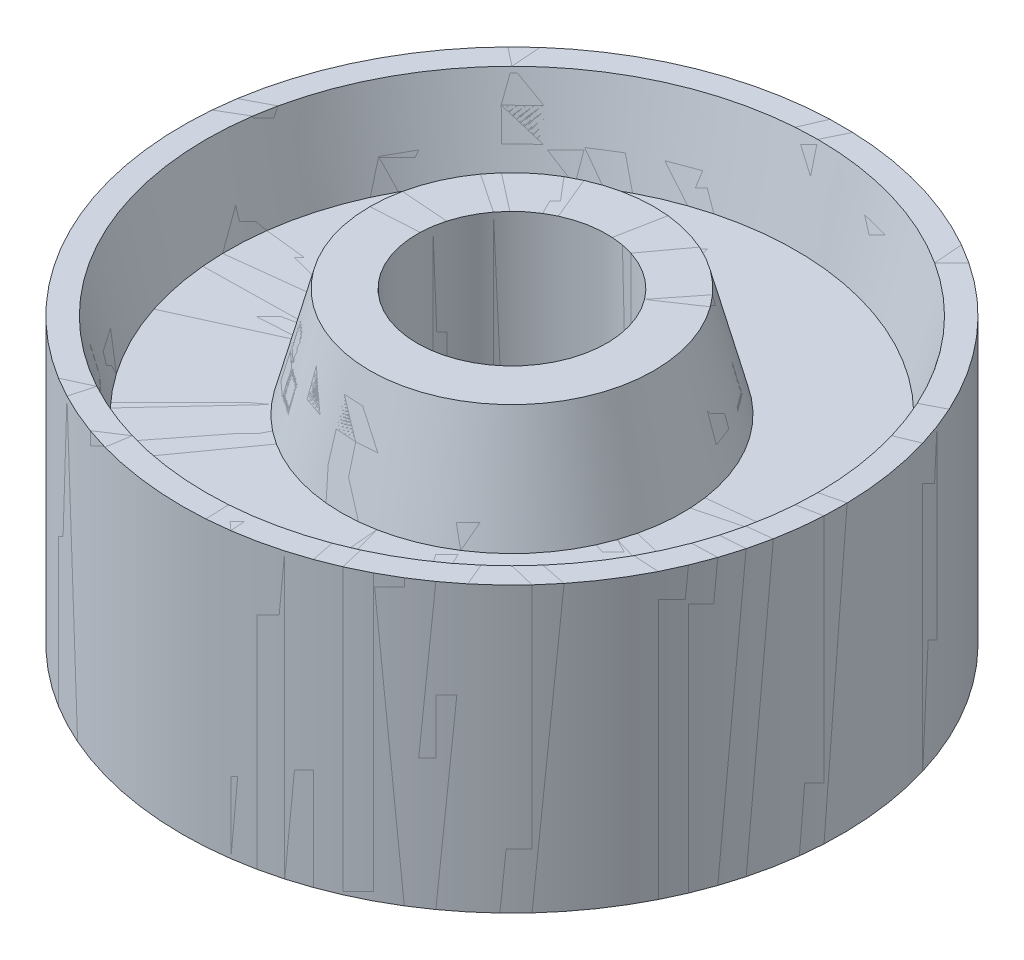
ISO-10303-21;
HEADER;
FILE_DESCRIPTION(('STEP AP214'),'2;1');
FILE_NAME('part.step','',(''),(''),'','','');
FILE_SCHEMA(('AUTOMOTIVE_DESIGN { 1 0 10303 214 1 1 1 1 }'));
ENDSEC;
DATA;
#1=APPLICATION_CONTEXT('core data for automotive mechanical design processes');
#2=APPLICATION_PROTOCOL_DEFINITION('international standard','automotive_design',2000,#1);
#3=PRODUCT_CONTEXT('',#1,'mechanical');
#4=PRODUCT('Part','Part','',(#3));
#5=PRODUCT_RELATED_PRODUCT_CATEGORY('part','',(#4));
#6=PRODUCT_DEFINITION_FORMATION('','',#4);
#7=PRODUCT_DEFINITION_CONTEXT('part definition',#1,'design');
#8=PRODUCT_DEFINITION('design','',#6,#7);
#9=PRODUCT_DEFINITION_SHAPE('','',#8);
#10=(LENGTH_UNIT() NAMED_UNIT(*) SI_UNIT(.MILLI.,.METRE.));
#11=(NAMED_UNIT(*) PLANE_ANGLE_UNIT() SI_UNIT($,.RADIAN.));
#12=(NAMED_UNIT(*) SI_UNIT($,.STERADIAN.) SOLID_ANGLE_UNIT());
#13=UNCERTAINTY_MEASURE_WITH_UNIT(LENGTH_MEASURE(1.E-05),#10,'distance_accuracy_value','');
#14=(GEOMETRIC_REPRESENTATION_CONTEXT(3) GLOBAL_UNCERTAINTY_ASSIGNED_CONTEXT((#13)) GLOBAL_UNIT_ASSIGNED_CONTEXT((#10,
#11,#12)) REPRESENTATION_CONTEXT('',''));
#15=CARTESIAN_POINT('',(0.,0.,0.));
#16=DIRECTION('',(0.,0.,1.));
#17=DIRECTION('',(1.,0.,0.));
#18=AXIS2_PLACEMENT_3D('',#15,#16,#17);
#19=CARTESIAN_POINT('',(41.021,17.7742163580739,0.));
#20=DIRECTION('',(0.,-1.,0.));
#21=DIRECTION('',(0.,0.,-1.));
#22=AXIS2_PLACEMENT_3D('',#19,#20,#21);
#23=PLANE('',#22);
#24=CARTESIAN_POINT('',(0.,17.7742163580739,0.));
#25=DIRECTION('',(0.,1.,0.));
#26=DIRECTION('',(0.,0.,1.));
#27=AXIS2_PLACEMENT_3D('',#24,#25,#26);
#28=CIRCLE('',#27,41.021);
#29=CARTESIAN_POINT('',(0.,17.7742163580739,41.021));
#30=VERTEX_POINT('',#29);
#31=EDGE_CURVE('E96',#30,#30,#28,.T.);
#32=ORIENTED_EDGE('',*,*,#31,.F.);
#33=EDGE_LOOP('',(#32));
#34=FACE_BOUND('',#33,.T.);
#35=CARTESIAN_POINT('',(0.,17.7742163580739,0.));
#36=DIRECTION('',(0.,1.,0.));
#37=DIRECTION('',(0.,0.,1.));
#38=AXIS2_PLACEMENT_3D('',#35,#36,#37);
#39=CIRCLE('',#38,44.196);
#40=CARTESIAN_POINT('',(0.,17.7742163580739,44.196));
#41=VERTEX_POINT('',#40);
#42=EDGE_CURVE('E11',#41,#41,#39,.T.);
#43=ORIENTED_EDGE('',*,*,#42,.T.);
#44=EDGE_LOOP('',(#43));
#45=FACE_BOUND('',#44,.T.);
#46=ADVANCED_FACE('F45',(#34,#45),#23,.F.);
#47=CARTESIAN_POINT('',(0.,42.7314059871606,0.));
#48=DIRECTION('',(0.,1.,0.));
#49=DIRECTION('',(0.,0.,1.));
#50=AXIS2_PLACEMENT_3D('',#47,#48,#49);
#51=CYLINDRICAL_SURFACE('',#50,44.196);
#52=ORIENTED_EDGE('',*,*,#42,.F.);
#53=EDGE_LOOP('',(#52));
#54=FACE_BOUND('',#53,.T.);
#55=CARTESIAN_POINT('',(0.,-20.3257836419261,0.));
#56=DIRECTION('',(0.,1.,0.));
#57=DIRECTION('',(0.,0.,1.));
#58=AXIS2_PLACEMENT_3D('',#55,#56,#57);
#59=CIRCLE('',#58,44.196);
#60=CARTESIAN_POINT('',(0.,-20.3257836419261,44.196));
#61=VERTEX_POINT('',#60);
#62=EDGE_CURVE('E52',#61,#61,#59,.T.);
#63=ORIENTED_EDGE('',*,*,#62,.T.);
#64=EDGE_LOOP('',(#63));
#65=FACE_BOUND('',#64,.T.);
#66=ADVANCED_FACE('F104',(#54,#65),#51,.T.);
#67=CARTESIAN_POINT('',(44.196,-20.3257836419261,0.));
#68=DIRECTION('',(0.,1.,0.));
#69=DIRECTION('',(0.,0.,1.));
#70=AXIS2_PLACEMENT_3D('',#67,#68,#69);
#71=PLANE('',#70);
#72=ORIENTED_EDGE('',*,*,#62,.F.);
#73=EDGE_LOOP('',(#72));
#74=FACE_BOUND('',#73,.T.);
#75=CARTESIAN_POINT('',(0.,-20.3257836419261,0.));
#76=DIRECTION('',(0.,1.,0.));
#77=DIRECTION('',(0.,0.,1.));
#78=AXIS2_PLACEMENT_3D('',#75,#76,#77);
#79=CIRCLE('',#78,41.021);
#80=CARTESIAN_POINT('',(0.,-20.3257836419261,41.021));
#81=VERTEX_POINT('',#80);
#82=EDGE_CURVE('E57',#81,#81,#79,.T.);
#83=ORIENTED_EDGE('',*,*,#82,.T.);
#84=EDGE_LOOP('',(#83));
#85=FACE_BOUND('',#84,.T.);
#86=ADVANCED_FACE('F108',(#74,#85),#71,.F.);
#87=CARTESIAN_POINT('',(0.,-8.89578364192612,0.));
#88=DIRECTION('',(0.,-1.,0.));
#89=DIRECTION('',(0.,0.,-1.));
#90=AXIS2_PLACEMENT_3D('',#87,#88,#89);
#91=CONICAL_SURFACE('',#90,38.1,0.25020054777764);
#92=ORIENTED_EDGE('',*,*,#82,.F.);
#93=EDGE_LOOP('',(#92));
#94=FACE_BOUND('',#93,.T.);
#95=CARTESIAN_POINT('',(0.,-8.89578364192612,0.));
#96=DIRECTION('',(0.,1.,0.));
#97=DIRECTION('',(0.,0.,1.));
#98=AXIS2_PLACEMENT_3D('',#95,#96,#97);
#99=CIRCLE('',#98,38.1);
#100=CARTESIAN_POINT('',(0.,-8.89578364192612,38.1));
#101=VERTEX_POINT('',#100);
#102=EDGE_CURVE('E62',#101,#101,#99,.T.);
#103=ORIENTED_EDGE('',*,*,#102,.T.);
#104=EDGE_LOOP('',(#103));
#105=FACE_BOUND('',#104,.T.);
#106=ADVANCED_FACE('F113',(#94,#105),#91,.F.);
#107=CARTESIAN_POINT('',(38.1,-8.89578364192612,0.));
#108=DIRECTION('',(0.,1.,0.));
#109=DIRECTION('',(0.,0.,1.));
#110=AXIS2_PLACEMENT_3D('',#107,#108,#109);
#111=PLANE('',#110);
#112=ORIENTED_EDGE('',*,*,#102,.F.);
#113=EDGE_LOOP('',(#112));
#114=FACE_BOUND('',#113,.T.);
#115=CARTESIAN_POINT('',(0.,-8.89578364192611,0.));
#116=DIRECTION('',(0.,1.,0.));
#117=DIRECTION('',(0.,0.,1.));
#118=AXIS2_PLACEMENT_3D('',#115,#116,#117);
#119=CIRCLE('',#118,22.86);
#120=CARTESIAN_POINT('',(0.,-8.89578364192611,22.86));
#121=VERTEX_POINT('',#120);
#122=EDGE_CURVE('E68',#121,#121,#119,.T.);
#123=ORIENTED_EDGE('',*,*,#122,.T.);
#124=EDGE_LOOP('',(#123));
#125=FACE_BOUND('',#124,.T.);
#126=ADVANCED_FACE('F119',(#114,#125),#111,.F.);
#127=CARTESIAN_POINT('',(0.,-23.5007836419261,0.));
#128=DIRECTION('',(0.,1.,0.));
#129=DIRECTION('',(0.,0.,1.));
#130=AXIS2_PLACEMENT_3D('',#127,#128,#129);
#131=CONICAL_SURFACE('',#130,19.05,0.255182390620818);
#132=ORIENTED_EDGE('',*,*,#122,.F.);
#133=EDGE_LOOP('',(#132));
#134=FACE_BOUND('',#133,.T.);
#135=CARTESIAN_POINT('',(0.,-23.5007836419261,0.));
#136=DIRECTION('',(0.,1.,0.));
#137=DIRECTION('',(0.,0.,1.));
#138=AXIS2_PLACEMENT_3D('',#135,#136,#137);
#139=CIRCLE('',#138,19.05);
#140=CARTESIAN_POINT('',(0.,-23.5007836419261,19.05));
#141=VERTEX_POINT('',#140);
#142=EDGE_CURVE('E72',#141,#141,#139,.T.);
#143=ORIENTED_EDGE('',*,*,#142,.T.);
#144=EDGE_LOOP('',(#143));
#145=FACE_BOUND('',#144,.T.);
#146=ADVANCED_FACE('F123',(#134,#145),#131,.T.);
#147=CARTESIAN_POINT('',(19.05,-23.5007836419261,0.));
#148=DIRECTION('',(0.,1.,0.));
#149=DIRECTION('',(0.,0.,1.));
#150=AXIS2_PLACEMENT_3D('',#147,#148,#149);
#151=PLANE('',#150);
#152=ORIENTED_EDGE('',*,*,#142,.F.);
#153=EDGE_LOOP('',(#152));
#154=FACE_BOUND('',#153,.T.);
#155=CARTESIAN_POINT('',(0.,-23.5007836419261,0.));
#156=DIRECTION('',(0.,1.,0.));
#157=DIRECTION('',(0.,0.,1.));
#158=AXIS2_PLACEMENT_3D('',#155,#156,#157);
#159=CIRCLE('',#158,12.7);
#160=CARTESIAN_POINT('',(0.,-23.5007836419261,12.7));
#161=VERTEX_POINT('',#160);
#162=EDGE_CURVE('E76',#161,#161,#159,.T.);
#163=ORIENTED_EDGE('',*,*,#162,.T.);
#164=EDGE_LOOP('',(#163));
#165=FACE_BOUND('',#164,.T.);
#166=ADVANCED_FACE('F127',(#154,#165),#151,.F.);
#167=CARTESIAN_POINT('',(0.,42.7314059871606,0.));
#168=DIRECTION('',(0.,1.,0.));
#169=DIRECTION('',(0.,0.,1.));
#170=AXIS2_PLACEMENT_3D('',#167,#168,#169);
#171=CYLINDRICAL_SURFACE('',#170,12.7);
#172=ORIENTED_EDGE('',*,*,#162,.F.);
#173=EDGE_LOOP('',(#172));
#174=FACE_BOUND('',#173,.T.);
#175=CARTESIAN_POINT('',(0.,20.9492163580739,0.));
#176=DIRECTION('',(0.,1.,0.));
#177=DIRECTION('',(0.,0.,1.));
#178=AXIS2_PLACEMENT_3D('',#175,#176,#177);
#179=CIRCLE('',#178,12.7);
#180=CARTESIAN_POINT('',(0.,20.9492163580739,12.7));
#181=VERTEX_POINT('',#180);
#182=EDGE_CURVE('E80',#181,#181,#179,.T.);
#183=ORIENTED_EDGE('',*,*,#182,.T.);
#184=EDGE_LOOP('',(#183));
#185=FACE_BOUND('',#184,.T.);
#186=ADVANCED_FACE('F131',(#174,#185),#171,.F.);
#187=CARTESIAN_POINT('',(12.7,20.9492163580739,0.));
#188=DIRECTION('',(0.,-1.,0.));
#189=DIRECTION('',(0.,0.,-1.));
#190=AXIS2_PLACEMENT_3D('',#187,#188,#189);
#191=PLANE('',#190);
#192=ORIENTED_EDGE('',*,*,#182,.F.);
#193=EDGE_LOOP('',(#192));
#194=FACE_BOUND('',#193,.T.);
#195=CARTESIAN_POINT('',(0.,20.9492163580739,0.));
#196=DIRECTION('',(0.,1.,0.));
#197=DIRECTION('',(0.,0.,1.));
#198=AXIS2_PLACEMENT_3D('',#195,#196,#197);
#199=CIRCLE('',#198,19.05);
#200=CARTESIAN_POINT('',(0.,20.9492163580739,19.05));
#201=VERTEX_POINT('',#200);
#202=EDGE_CURVE('E84',#201,#201,#199,.T.);
#203=ORIENTED_EDGE('',*,*,#202,.T.);
#204=EDGE_LOOP('',(#203));
#205=FACE_BOUND('',#204,.T.);
#206=ADVANCED_FACE('F135',(#194,#205),#191,.F.);
#207=CARTESIAN_POINT('',(0.,6.34421635807388,0.));
#208=DIRECTION('',(0.,-1.,0.));
#209=DIRECTION('',(0.,0.,-1.));
#210=AXIS2_PLACEMENT_3D('',#207,#208,#209);
#211=CONICAL_SURFACE('',#210,22.86,0.255182390620818);
#212=ORIENTED_EDGE('',*,*,#202,.F.);
#213=EDGE_LOOP('',(#212));
#214=FACE_BOUND('',#213,.T.);
#215=CARTESIAN_POINT('',(0.,6.34421635807388,0.));
#216=DIRECTION('',(0.,1.,0.));
#217=DIRECTION('',(0.,0.,1.));
#218=AXIS2_PLACEMENT_3D('',#215,#216,#217);
#219=CIRCLE('',#218,22.86);
#220=CARTESIAN_POINT('',(0.,6.34421635807388,22.86));
#221=VERTEX_POINT('',#220);
#222=EDGE_CURVE('E88',#221,#221,#219,.T.);
#223=ORIENTED_EDGE('',*,*,#222,.T.);
#224=EDGE_LOOP('',(#223));
#225=FACE_BOUND('',#224,.T.);
#226=ADVANCED_FACE('F139',(#214,#225),#211,.T.);
#227=CARTESIAN_POINT('',(22.86,6.34421635807388,0.));
#228=DIRECTION('',(0.,-1.,0.));
#229=DIRECTION('',(0.,0.,-1.));
#230=AXIS2_PLACEMENT_3D('',#227,#228,#229);
#231=PLANE('',#230);
#232=ORIENTED_EDGE('',*,*,#222,.F.);
#233=EDGE_LOOP('',(#232));
#234=FACE_BOUND('',#233,.T.);
#235=CARTESIAN_POINT('',(0.,6.34421635807388,0.));
#236=DIRECTION('',(0.,1.,0.));
#237=DIRECTION('',(0.,0.,1.));
#238=AXIS2_PLACEMENT_3D('',#235,#236,#237);
#239=CIRCLE('',#238,38.1);
#240=CARTESIAN_POINT('',(0.,6.34421635807388,38.1));
#241=VERTEX_POINT('',#240);
#242=EDGE_CURVE('E92',#241,#241,#239,.T.);
#243=ORIENTED_EDGE('',*,*,#242,.T.);
#244=EDGE_LOOP('',(#243));
#245=FACE_BOUND('',#244,.T.);
#246=ADVANCED_FACE('F143',(#234,#245),#231,.F.);
#247=CARTESIAN_POINT('',(0.,17.7742163580739,0.));
#248=DIRECTION('',(0.,1.,0.));
#249=DIRECTION('',(0.,0.,1.));
#250=AXIS2_PLACEMENT_3D('',#247,#248,#249);
#251=CONICAL_SURFACE('',#250,41.021,0.25020054777764);
#252=ORIENTED_EDGE('',*,*,#242,.F.);
#253=EDGE_LOOP('',(#252));
#254=FACE_BOUND('',#253,.T.);
#255=ORIENTED_EDGE('',*,*,#31,.T.);
#256=EDGE_LOOP('',(#255));
#257=FACE_BOUND('',#256,.T.);
#258=ADVANCED_FACE('F101',(#254,#257),#251,.F.);
#259=CLOSED_SHELL('',(#46,#66,#86,#106,#126,#146,#166,#186,#206,#226,#246,#258));
#260=MANIFOLD_SOLID_BREP('B2',#259);
#261=CARTESIAN_POINT('',(0.,42.7314059871606,0.));
#262=DIRECTION('',(0.,1.,0.));
#263=DIRECTION('',(0.,0.,1.));
#264=AXIS2_PLACEMENT_3D('',#261,#262,#263);
#265=CYLINDRICAL_SURFACE('',#264,44.196);
#266=CARTESIAN_POINT('',(0.,-20.3257836419261,0.));
#267=DIRECTION('',(0.,1.,0.));
#268=DIRECTION('',(0.,0.,1.));
#269=AXIS2_PLACEMENT_3D('',#266,#267,#268);
#270=CIRCLE('',#269,44.196);
#271=CARTESIAN_POINT('',(0.,-20.3257836419261,44.196));
#272=VERTEX_POINT('',#271);
#273=EDGE_CURVE('E44',#272,#272,#270,.T.);
#274=ORIENTED_EDGE('',*,*,#273,.T.);
#275=EDGE_LOOP('',(#274));
#276=FACE_BOUND('',#275,.T.);
#277=CARTESIAN_POINT('',(0.,17.7742163580739,0.));
#278=DIRECTION('',(0.,1.,0.));
#279=DIRECTION('',(0.,0.,1.));
#280=AXIS2_PLACEMENT_3D('',#277,#278,#279);
#281=CIRCLE('',#280,44.196);
#282=CARTESIAN_POINT('',(0.,17.7742163580739,44.196));
#283=VERTEX_POINT('',#282);
#284=EDGE_CURVE('E279',#283,#283,#281,.T.);
#285=ORIENTED_EDGE('',*,*,#284,.F.);
#286=EDGE_LOOP('',(#285));
#287=FACE_BOUND('',#286,.T.);
#288=ADVANCED_FACE('F239',(#276,#287),#265,.T.);
#289=CARTESIAN_POINT('',(-44.196,-20.3257836419261,0.));
#290=DIRECTION('',(0.,-1.,0.));
#291=DIRECTION('',(0.,0.,-1.));
#292=AXIS2_PLACEMENT_3D('',#289,#290,#291);
#293=PLANE('',#292);
#294=CARTESIAN_POINT('',(0.,-20.3257836419261,0.));
#295=DIRECTION('',(0.,1.,0.));
#296=DIRECTION('',(0.,0.,1.));
#297=AXIS2_PLACEMENT_3D('',#294,#295,#296);
#298=CIRCLE('',#297,41.021);
#299=CARTESIAN_POINT('',(0.,-20.3257836419261,41.021));
#300=VERTEX_POINT('',#299);
#301=EDGE_CURVE('E245',#300,#300,#298,.T.);
#302=ORIENTED_EDGE('',*,*,#301,.T.);
#303=EDGE_LOOP('',(#302));
#304=FACE_BOUND('',#303,.T.);
#305=ORIENTED_EDGE('',*,*,#273,.F.);
#306=EDGE_LOOP('',(#305));
#307=FACE_BOUND('',#306,.T.);
#308=ADVANCED_FACE('F287',(#304,#307),#293,.T.);
#309=CARTESIAN_POINT('',(0.,-20.3257836419261,0.));
#310=DIRECTION('',(0.,-1.,0.));
#311=DIRECTION('',(0.,0.,-1.));
#312=AXIS2_PLACEMENT_3D('',#309,#310,#311);
#313=CONICAL_SURFACE('',#312,41.021,0.25020054777764);
#314=CARTESIAN_POINT('',(0.,-8.89578364192611,0.));
#315=DIRECTION('',(0.,1.,0.));
#316=DIRECTION('',(0.,0.,1.));
#317=AXIS2_PLACEMENT_3D('',#314,#315,#316);
#318=CIRCLE('',#317,38.1);
#319=CARTESIAN_POINT('',(0.,-8.89578364192611,38.1));
#320=VERTEX_POINT('',#319);
#321=EDGE_CURVE('E249',#320,#320,#318,.T.);
#322=ORIENTED_EDGE('',*,*,#321,.T.);
#323=EDGE_LOOP('',(#322));
#324=FACE_BOUND('',#323,.T.);
#325=ORIENTED_EDGE('',*,*,#301,.F.);
#326=EDGE_LOOP('',(#325));
#327=FACE_BOUND('',#326,.T.);
#328=ADVANCED_FACE('F291',(#324,#327),#313,.F.);
#329=CARTESIAN_POINT('',(-38.1,-8.89578364192611,0.));
#330=DIRECTION('',(0.,-1.,0.));
#331=DIRECTION('',(0.,0.,-1.));
#332=AXIS2_PLACEMENT_3D('',#329,#330,#331);
#333=PLANE('',#332);
#334=CARTESIAN_POINT('',(0.,-8.89578364192611,0.));
#335=DIRECTION('',(0.,1.,0.));
#336=DIRECTION('',(0.,0.,1.));
#337=AXIS2_PLACEMENT_3D('',#334,#335,#336);
#338=CIRCLE('',#337,22.86);
#339=CARTESIAN_POINT('',(0.,-8.89578364192611,22.86));
#340=VERTEX_POINT('',#339);
#341=EDGE_CURVE('E253',#340,#340,#338,.T.);
#342=ORIENTED_EDGE('',*,*,#341,.T.);
#343=EDGE_LOOP('',(#342));
#344=FACE_BOUND('',#343,.T.);
#345=ORIENTED_EDGE('',*,*,#321,.F.);
#346=EDGE_LOOP('',(#345));
#347=FACE_BOUND('',#346,.T.);
#348=ADVANCED_FACE('F295',(#344,#347),#333,.T.);
#349=CARTESIAN_POINT('',(0.,-8.89578364192611,0.));
#350=DIRECTION('',(0.,1.,0.));
#351=DIRECTION('',(0.,0.,1.));
#352=AXIS2_PLACEMENT_3D('',#349,#350,#351);
#353=CONICAL_SURFACE('',#352,22.86,0.255182390620818);
#354=CARTESIAN_POINT('',(0.,-23.5007836419261,0.));
#355=DIRECTION('',(0.,1.,0.));
#356=DIRECTION('',(0.,0.,1.));
#357=AXIS2_PLACEMENT_3D('',#354,#355,#356);
#358=CIRCLE('',#357,19.05);
#359=CARTESIAN_POINT('',(0.,-23.5007836419261,19.05));
#360=VERTEX_POINT('',#359);
#361=EDGE_CURVE('E258',#360,#360,#358,.T.);
#362=ORIENTED_EDGE('',*,*,#361,.T.);
#363=EDGE_LOOP('',(#362));
#364=FACE_BOUND('',#363,.T.);
#365=ORIENTED_EDGE('',*,*,#341,.F.);
#366=EDGE_LOOP('',(#365));
#367=FACE_BOUND('',#366,.T.);
#368=ADVANCED_FACE('F302',(#364,#367),#353,.T.);
#369=CARTESIAN_POINT('',(-19.05,-23.5007836419261,0.));
#370=DIRECTION('',(0.,-1.,0.));
#371=DIRECTION('',(0.,0.,-1.));
#372=AXIS2_PLACEMENT_3D('',#369,#370,#371);
#373=PLANE('',#372);
#374=CARTESIAN_POINT('',(0.,-23.5007836419261,0.));
#375=DIRECTION('',(0.,1.,0.));
#376=DIRECTION('',(0.,0.,1.));
#377=AXIS2_PLACEMENT_3D('',#374,#375,#376);
#378=CIRCLE('',#377,12.7);
#379=CARTESIAN_POINT('',(0.,-23.5007836419261,12.7));
#380=VERTEX_POINT('',#379);
#381=EDGE_CURVE('E261',#380,#380,#378,.T.);
#382=ORIENTED_EDGE('',*,*,#381,.T.);
#383=EDGE_LOOP('',(#382));
#384=FACE_BOUND('',#383,.T.);
#385=ORIENTED_EDGE('',*,*,#361,.F.);
#386=EDGE_LOOP('',(#385));
#387=FACE_BOUND('',#386,.T.);
#388=ADVANCED_FACE('F306',(#384,#387),#373,.T.);
#389=CARTESIAN_POINT('',(0.,42.7314059871606,0.));
#390=DIRECTION('',(0.,1.,0.));
#391=DIRECTION('',(0.,0.,1.));
#392=AXIS2_PLACEMENT_3D('',#389,#390,#391);
#393=CYLINDRICAL_SURFACE('',#392,12.7);
#394=CARTESIAN_POINT('',(0.,20.9492163580739,0.));
#395=DIRECTION('',(0.,1.,0.));
#396=DIRECTION('',(0.,0.,1.));
#397=AXIS2_PLACEMENT_3D('',#394,#395,#396);
#398=CIRCLE('',#397,12.7);
#399=CARTESIAN_POINT('',(0.,20.9492163580739,12.7));
#400=VERTEX_POINT('',#399);
#401=EDGE_CURVE('E264',#400,#400,#398,.T.);
#402=ORIENTED_EDGE('',*,*,#401,.T.);
#403=EDGE_LOOP('',(#402));
#404=FACE_BOUND('',#403,.T.);
#405=ORIENTED_EDGE('',*,*,#381,.F.);
#406=EDGE_LOOP('',(#405));
#407=FACE_BOUND('',#406,.T.);
#408=ADVANCED_FACE('F310',(#404,#407),#393,.F.);
#409=CARTESIAN_POINT('',(-12.7,20.9492163580739,0.));
#410=DIRECTION('',(0.,1.,0.));
#411=DIRECTION('',(0.,0.,1.));
#412=AXIS2_PLACEMENT_3D('',#409,#410,#411);
#413=PLANE('',#412);
#414=CARTESIAN_POINT('',(0.,20.9492163580739,0.));
#415=DIRECTION('',(0.,1.,0.));
#416=DIRECTION('',(0.,0.,1.));
#417=AXIS2_PLACEMENT_3D('',#414,#415,#416);
#418=CIRCLE('',#417,19.05);
#419=CARTESIAN_POINT('',(0.,20.9492163580739,19.05));
#420=VERTEX_POINT('',#419);
#421=EDGE_CURVE('E267',#420,#420,#418,.T.);
#422=ORIENTED_EDGE('',*,*,#421,.T.);
#423=EDGE_LOOP('',(#422));
#424=FACE_BOUND('',#423,.T.);
#425=ORIENTED_EDGE('',*,*,#401,.F.);
#426=EDGE_LOOP('',(#425));
#427=FACE_BOUND('',#426,.T.);
#428=ADVANCED_FACE('F314',(#424,#427),#413,.T.);
#429=CARTESIAN_POINT('',(0.,20.9492163580739,0.));
#430=DIRECTION('',(0.,-1.,0.));
#431=DIRECTION('',(0.,0.,-1.));
#432=AXIS2_PLACEMENT_3D('',#429,#430,#431);
#433=CONICAL_SURFACE('',#432,19.05,0.255182390620818);
#434=CARTESIAN_POINT('',(0.,6.34421635807388,0.));
#435=DIRECTION('',(0.,1.,0.));
#436=DIRECTION('',(0.,0.,1.));
#437=AXIS2_PLACEMENT_3D('',#434,#435,#436);
#438=CIRCLE('',#437,22.86);
#439=CARTESIAN_POINT('',(0.,6.34421635807388,22.86));
#440=VERTEX_POINT('',#439);
#441=EDGE_CURVE('E270',#440,#440,#438,.T.);
#442=ORIENTED_EDGE('',*,*,#441,.T.);
#443=EDGE_LOOP('',(#442));
#444=FACE_BOUND('',#443,.T.);
#445=ORIENTED_EDGE('',*,*,#421,.F.);
#446=EDGE_LOOP('',(#445));
#447=FACE_BOUND('',#446,.T.);
#448=ADVANCED_FACE('F318',(#444,#447),#433,.T.);
#449=CARTESIAN_POINT('',(-22.86,6.34421635807388,0.));
#450=DIRECTION('',(0.,1.,0.));
#451=DIRECTION('',(0.,0.,1.));
#452=AXIS2_PLACEMENT_3D('',#449,#450,#451);
#453=PLANE('',#452);
#454=CARTESIAN_POINT('',(0.,6.34421635807388,0.));
#455=DIRECTION('',(0.,1.,0.));
#456=DIRECTION('',(0.,0.,1.));
#457=AXIS2_PLACEMENT_3D('',#454,#455,#456);
#458=CIRCLE('',#457,38.1);
#459=CARTESIAN_POINT('',(0.,6.34421635807388,38.1));
#460=VERTEX_POINT('',#459);
#461=EDGE_CURVE('E273',#460,#460,#458,.T.);
#462=ORIENTED_EDGE('',*,*,#461,.T.);
#463=EDGE_LOOP('',(#462));
#464=FACE_BOUND('',#463,.T.);
#465=ORIENTED_EDGE('',*,*,#441,.F.);
#466=EDGE_LOOP('',(#465));
#467=FACE_BOUND('',#466,.T.);
#468=ADVANCED_FACE('F322',(#464,#467),#453,.T.);
#469=CARTESIAN_POINT('',(0.,6.34421635807388,0.));
#470=DIRECTION('',(0.,1.,0.));
#471=DIRECTION('',(0.,0.,1.));
#472=AXIS2_PLACEMENT_3D('',#469,#470,#471);
#473=CONICAL_SURFACE('',#472,38.1,0.25020054777764);
#474=CARTESIAN_POINT('',(0.,17.7742163580739,0.));
#475=DIRECTION('',(0.,1.,0.));
#476=DIRECTION('',(0.,0.,1.));
#477=AXIS2_PLACEMENT_3D('',#474,#475,#476);
#478=CIRCLE('',#477,41.021);
#479=CARTESIAN_POINT('',(0.,17.7742163580739,41.021));
#480=VERTEX_POINT('',#479);
#481=EDGE_CURVE('E276',#480,#480,#478,.T.);
#482=ORIENTED_EDGE('',*,*,#481,.T.);
#483=EDGE_LOOP('',(#482));
#484=FACE_BOUND('',#483,.T.);
#485=ORIENTED_EDGE('',*,*,#461,.F.);
#486=EDGE_LOOP('',(#485));
#487=FACE_BOUND('',#486,.T.);
#488=ADVANCED_FACE('F326',(#484,#487),#473,.F.);
#489=CARTESIAN_POINT('',(-41.021,17.7742163580739,0.));
#490=DIRECTION('',(0.,1.,0.));
#491=DIRECTION('',(0.,0.,1.));
#492=AXIS2_PLACEMENT_3D('',#489,#490,#491);
#493=PLANE('',#492);
#494=ORIENTED_EDGE('',*,*,#284,.T.);
#495=EDGE_LOOP('',(#494));
#496=FACE_BOUND('',#495,.T.);
#497=ORIENTED_EDGE('',*,*,#481,.F.);
#498=EDGE_LOOP('',(#497));
#499=FACE_BOUND('',#498,.T.);
#500=ADVANCED_FACE('F283',(#496,#499),#493,.T.);
#501=CLOSED_SHELL('',(#288,#308,#328,#348,#368,#388,#408,#428,#448,#468,#488,#500));
#502=MANIFOLD_SOLID_BREP('B6',#501);
#503=ADVANCED_BREP_SHAPE_REPRESENTATION('',(#18,#260,#502),#14);
#504=SHAPE_DEFINITION_REPRESENTATION(#9,#503);
ENDSEC;
END-ISO-10303-21;
